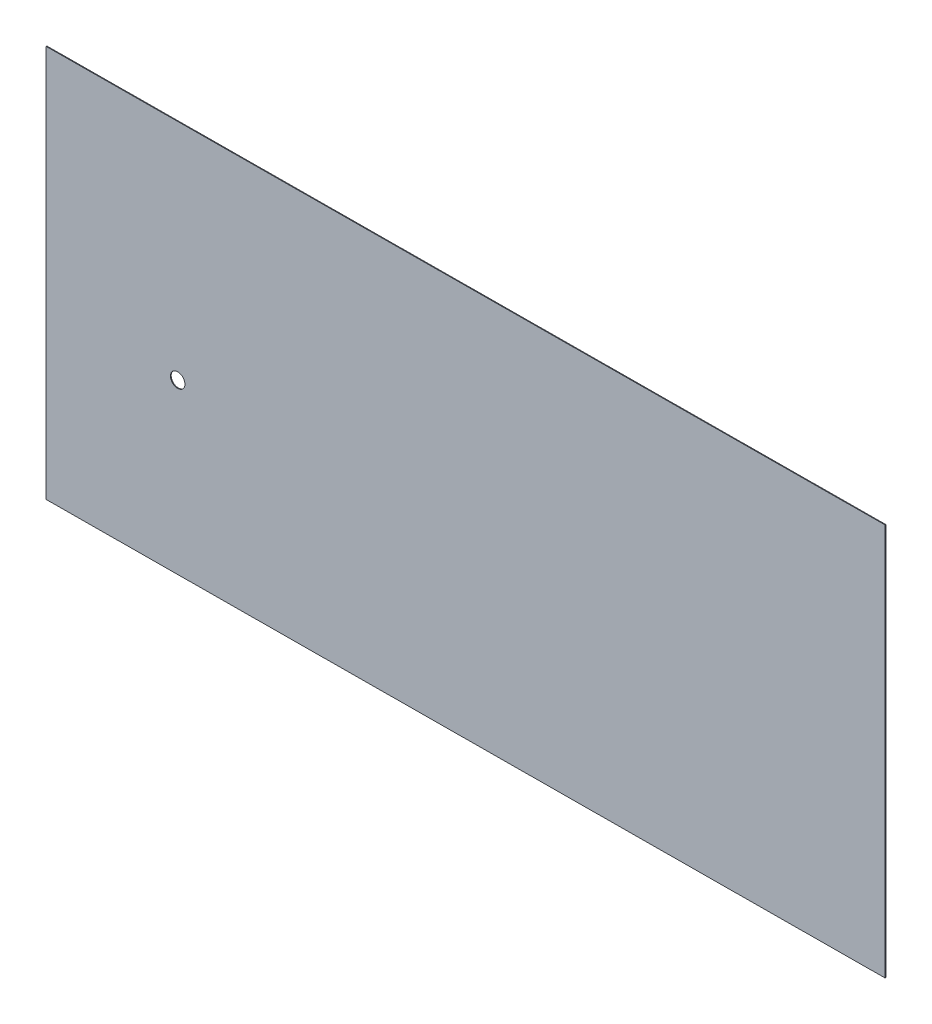
ISO-10303-21;
HEADER;
FILE_DESCRIPTION(('STEP AP214'),'2;1');
FILE_NAME('part.step','',(''),(''),'','','');
FILE_SCHEMA(('AUTOMOTIVE_DESIGN { 1 0 10303 214 1 1 1 1 }'));
ENDSEC;
DATA;
#1=APPLICATION_CONTEXT('core data for automotive mechanical design processes');
#2=APPLICATION_PROTOCOL_DEFINITION('international standard','automotive_design',2000,#1);
#3=PRODUCT_CONTEXT('',#1,'mechanical');
#4=PRODUCT('Part','Part','',(#3));
#5=PRODUCT_RELATED_PRODUCT_CATEGORY('part','',(#4));
#6=PRODUCT_DEFINITION_FORMATION('','',#4);
#7=PRODUCT_DEFINITION_CONTEXT('part definition',#1,'design');
#8=PRODUCT_DEFINITION('design','',#6,#7);
#9=PRODUCT_DEFINITION_SHAPE('','',#8);
#10=(LENGTH_UNIT() NAMED_UNIT(*) SI_UNIT(.MILLI.,.METRE.));
#11=(NAMED_UNIT(*) PLANE_ANGLE_UNIT() SI_UNIT($,.RADIAN.));
#12=(NAMED_UNIT(*) SI_UNIT($,.STERADIAN.) SOLID_ANGLE_UNIT());
#13=UNCERTAINTY_MEASURE_WITH_UNIT(LENGTH_MEASURE(1.E-05),#10,'distance_accuracy_value','');
#14=(GEOMETRIC_REPRESENTATION_CONTEXT(3) GLOBAL_UNCERTAINTY_ASSIGNED_CONTEXT((#13)) GLOBAL_UNIT_ASSIGNED_CONTEXT((#10,
#11,#12)) REPRESENTATION_CONTEXT('',''));
#15=CARTESIAN_POINT('',(0.,0.,0.));
#16=DIRECTION('',(0.,0.,1.));
#17=DIRECTION('',(1.,0.,0.));
#18=AXIS2_PLACEMENT_3D('',#15,#16,#17);
#19=CARTESIAN_POINT('',(-4.99393203883525,546.5,-822.984848367691));
#20=DIRECTION('',(0.999981589754181,0.,-0.00606796116504866));
#21=DIRECTION('',(0.,1.,0.));
#22=AXIS2_PLACEMENT_3D('',#19,#20,#21);
#23=PLANE('',#22);
#24=DIRECTION('',(0.00606796116504867,0.,0.999981589754181));
#25=VECTOR('',#24,1.);
#26=CARTESIAN_POINT('',(-4.99393203883525,1093.,-822.984848367691));
#27=LINE('',#26,#25);
#28=CARTESIAN_POINT('',(-5.000000000001,1093.,-823.984829957446));
#29=VERTEX_POINT('',#28);
#30=CARTESIAN_POINT('',(-4.9878640776706,1093.,-821.984866777937));
#31=VERTEX_POINT('',#30);
#32=EDGE_CURVE('E11',#29,#31,#27,.T.);
#33=ORIENTED_EDGE('',*,*,#32,.F.);
#34=DIRECTION('',(0.,1.,0.));
#35=VECTOR('',#34,1.);
#36=CARTESIAN_POINT('',(-5.000000000001,546.5,-823.984829957446));
#37=LINE('',#36,#35);
#38=CARTESIAN_POINT('',(-5.000000000001,0.,-823.984829957446));
#39=VERTEX_POINT('',#38);
#40=EDGE_CURVE('E79',#29,#39,#37,.F.);
#41=ORIENTED_EDGE('',*,*,#40,.T.);
#42=DIRECTION('',(0.00606796116504867,0.,0.999981589754181));
#43=VECTOR('',#42,1.);
#44=CARTESIAN_POINT('',(-4.99393203883525,0.,-822.984848367691));
#45=LINE('',#44,#43);
#46=CARTESIAN_POINT('',(-4.9878640776706,0.,-821.984866777937));
#47=VERTEX_POINT('',#46);
#48=EDGE_CURVE('E51',#39,#47,#45,.T.);
#49=ORIENTED_EDGE('',*,*,#48,.T.);
#50=DIRECTION('',(0.,1.,0.));
#51=VECTOR('',#50,1.);
#52=CARTESIAN_POINT('',(-4.9878640776706,546.5,-821.984866777937));
#53=LINE('',#52,#51);
#54=EDGE_CURVE('E81',#31,#47,#53,.F.);
#55=ORIENTED_EDGE('',*,*,#54,.F.);
#56=EDGE_LOOP('',(#33,#41,#49,#55));
#57=FACE_BOUND('',#56,.T.);
#58=ADVANCED_FACE('F41',(#57),#23,.F.);
#59=CARTESIAN_POINT('',(1156.30423815181,0.,-830.031690299543));
#60=DIRECTION('',(0.,-1.,0.));
#61=DIRECTION('',(0.999981589754181,0.,-0.00606796116504866));
#62=AXIS2_PLACEMENT_3D('',#59,#60,#61);
#63=PLANE('',#62);
#64=ORIENTED_EDGE('',*,*,#48,.F.);
#65=DIRECTION('',(0.999981589754181,0.,-0.00606796116504866));
#66=VECTOR('',#65,1.);
#67=CARTESIAN_POINT('',(1156.29817019064,0.,-831.031671889297));
#68=LINE('',#67,#66);
#69=CARTESIAN_POINT('',(2317.59634038129,0.,-838.078513821148));
#70=VERTEX_POINT('',#69);
#71=EDGE_CURVE('E93',#39,#70,#68,.T.);
#72=ORIENTED_EDGE('',*,*,#71,.T.);
#73=DIRECTION('',(0.00606796116504867,0.,0.999981589754181));
#74=VECTOR('',#73,1.);
#75=CARTESIAN_POINT('',(2317.60240834245,0.,-837.078532231394));
#76=LINE('',#75,#74);
#77=CARTESIAN_POINT('',(2317.60847630362,0.,-836.078550641639));
#78=VERTEX_POINT('',#77);
#79=EDGE_CURVE('E108',#70,#78,#76,.T.);
#80=ORIENTED_EDGE('',*,*,#79,.T.);
#81=DIRECTION('',(0.999981589754181,0.,-0.00606796116504866));
#82=VECTOR('',#81,1.);
#83=CARTESIAN_POINT('',(1156.31030611297,0.,-829.031708709788));
#84=LINE('',#83,#82);
#85=EDGE_CURVE('E102',#47,#78,#84,.T.);
#86=ORIENTED_EDGE('',*,*,#85,.F.);
#87=EDGE_LOOP('',(#64,#72,#80,#86));
#88=FACE_BOUND('',#87,.T.);
#89=ADVANCED_FACE('F116',(#88),#63,.T.);
#90=CARTESIAN_POINT('',(2317.60240834245,546.5,-837.078532231394));
#91=DIRECTION('',(0.999981589754181,0.,-0.00606796116504866));
#92=DIRECTION('',(0.,1.,0.));
#93=AXIS2_PLACEMENT_3D('',#90,#91,#92);
#94=PLANE('',#93);
#95=ORIENTED_EDGE('',*,*,#79,.F.);
#96=DIRECTION('',(0.,1.,0.));
#97=VECTOR('',#96,1.);
#98=CARTESIAN_POINT('',(2317.59634038129,546.5,-838.078513821148));
#99=LINE('',#98,#97);
#100=CARTESIAN_POINT('',(2317.59634038129,1093.,-838.078513821148));
#101=VERTEX_POINT('',#100);
#102=EDGE_CURVE('E98',#70,#101,#99,.T.);
#103=ORIENTED_EDGE('',*,*,#102,.T.);
#104=DIRECTION('',(0.00606796116504867,0.,0.999981589754181));
#105=VECTOR('',#104,1.);
#106=CARTESIAN_POINT('',(2317.60240834245,1093.,-837.078532231394));
#107=LINE('',#106,#105);
#108=CARTESIAN_POINT('',(2317.60847630362,1093.,-836.078550641639));
#109=VERTEX_POINT('',#108);
#110=EDGE_CURVE('E45',#101,#109,#107,.T.);
#111=ORIENTED_EDGE('',*,*,#110,.T.);
#112=DIRECTION('',(0.,1.,0.));
#113=VECTOR('',#112,1.);
#114=CARTESIAN_POINT('',(2317.60847630362,546.5,-836.078550641639));
#115=LINE('',#114,#113);
#116=EDGE_CURVE('E118',#78,#109,#115,.T.);
#117=ORIENTED_EDGE('',*,*,#116,.F.);
#118=EDGE_LOOP('',(#95,#103,#111,#117));
#119=FACE_BOUND('',#118,.T.);
#120=ADVANCED_FACE('F171',(#119),#94,.T.);
#121=CARTESIAN_POINT('',(1156.30423815181,1093.,-830.031690299543));
#122=DIRECTION('',(0.,-1.,0.));
#123=DIRECTION('',(0.999981589754181,0.,-0.00606796116504866));
#124=AXIS2_PLACEMENT_3D('',#121,#122,#123);
#125=PLANE('',#124);
#126=DIRECTION('',(0.999981589754181,0.,-0.00606796116504866));
#127=VECTOR('',#126,1.);
#128=CARTESIAN_POINT('',(1156.29817019064,1093.,-831.031671889297));
#129=LINE('',#128,#127);
#130=EDGE_CURVE('E91',#101,#29,#129,.F.);
#131=ORIENTED_EDGE('',*,*,#130,.T.);
#132=ORIENTED_EDGE('',*,*,#32,.T.);
#133=DIRECTION('',(0.999981589754181,0.,-0.00606796116504866));
#134=VECTOR('',#133,1.);
#135=CARTESIAN_POINT('',(1156.31030611297,1093.,-829.031708709788));
#136=LINE('',#135,#134);
#137=EDGE_CURVE('E115',#109,#31,#136,.F.);
#138=ORIENTED_EDGE('',*,*,#137,.F.);
#139=ORIENTED_EDGE('',*,*,#110,.F.);
#140=EDGE_LOOP('',(#131,#132,#138,#139));
#141=FACE_BOUND('',#140,.T.);
#142=ADVANCED_FACE('F43',(#141),#125,.F.);
#143=CARTESIAN_POINT('',(1156.31030611297,546.5,-829.031708709788));
#144=DIRECTION('',(0.00606796116504867,0.,0.999981589754181));
#145=DIRECTION('',(0.999981589754181,0.,-0.00606796116504866));
#146=AXIS2_PLACEMENT_3D('',#143,#144,#145);
#147=PLANE('',#146);
#148=CARTESIAN_POINT('',(339.074950675495,469.0000000268,-824.072665013075));
#149=CARTESIAN_POINT('',(339.074952175354,468.328584783968,-824.072665022177));
#150=CARTESIAN_POINT('',(339.109270419941,467.657108868376,-824.072873267786));
#151=CARTESIAN_POINT('',(339.245169879086,466.321042548984,-824.073697915608));
#152=CARTESIAN_POINT('',(339.346748960097,465.656451927458,-824.074314304875));
#153=CARTESIAN_POINT('',(339.593612302406,464.449151278049,-824.075812289628));
#154=CARTESIAN_POINT('',(339.728953983658,463.904381306161,-824.076633552813));
#155=CARTESIAN_POINT('',(340.044908442255,462.827879149409,-824.078550787494));
#156=CARTESIAN_POINT('',(340.225531299392,462.296149896439,-824.079646820155));
#157=CARTESIAN_POINT('',(340.529891044368,461.51132230611,-824.08149369727));
#158=CARTESIAN_POINT('',(340.637000907703,461.251665596134,-824.082143647727));
#159=CARTESIAN_POINT('',(340.86218373962,460.737150092206,-824.083510073562));
#160=CARTESIAN_POINT('',(340.980256731423,460.482291308418,-824.084226549081));
#161=CARTESIAN_POINT('',(341.350458081397,459.725569546191,-824.086472957853));
#162=CARTESIAN_POINT('',(341.618616336485,459.231438855324,-824.088100161688));
#163=CARTESIAN_POINT('',(342.195074381275,458.267799266706,-824.091598151116));
#164=CARTESIAN_POINT('',(342.503342534786,457.798271368953,-824.093468744738));
#165=CARTESIAN_POINT('',(343.158007303258,456.886586975724,-824.097441298265));
#166=CARTESIAN_POINT('',(343.504402925405,456.444429768001,-824.099543252146));
#167=CARTESIAN_POINT('',(344.23306707273,455.590874551994,-824.103964839296));
#168=CARTESIAN_POINT('',(344.615328194218,455.179470226782,-824.106284427641));
#169=CARTESIAN_POINT('',(345.413449958345,454.390659581939,-824.111127488672));
#170=CARTESIAN_POINT('',(345.829310711533,454.013253374179,-824.11365096203));
#171=CARTESIAN_POINT('',(346.692037001546,453.293955871417,-824.118886048034));
#172=CARTESIAN_POINT('',(347.138960933633,452.952134658138,-824.121598015025));
#173=CARTESIAN_POINT('',(348.059793722772,452.307013749988,-824.1271856955));
#174=CARTESIAN_POINT('',(348.533703530012,452.003715412744,-824.130061414749));
#175=CARTESIAN_POINT('',(349.505342994726,451.437768861924,-824.135957393833));
#176=CARTESIAN_POINT('',(350.003074469016,451.175123755352,-824.138977664694));
#177=CARTESIAN_POINT('',(350.764818901969,450.813411875849,-824.143599985429));
#178=CARTESIAN_POINT('',(351.021279558414,450.698209217535,-824.145156207383));
#179=CARTESIAN_POINT('',(351.538873406771,450.478828487614,-824.148297004577));
#180=CARTESIAN_POINT('',(351.800006590888,450.374650397616,-824.149881579769));
#181=CARTESIAN_POINT('',(352.590833119863,450.078427140048,-824.154680372782));
#182=CARTESIAN_POINT('',(353.126924769694,449.903181193952,-824.157933415984));
#183=CARTESIAN_POINT('',(354.21189057084,449.598290184663,-824.164517067537));
#184=CARTESIAN_POINT('',(354.760765850328,449.468649162546,-824.167847682735));
#185=CARTESIAN_POINT('',(355.867441774931,449.255716661479,-824.1745630729));
#186=CARTESIAN_POINT('',(356.425242535724,449.172425783747,-824.177947848568));
#187=CARTESIAN_POINT('',(357.54589935732,449.052978130169,-824.184748075835));
#188=CARTESIAN_POINT('',(358.108754956869,449.016817096848,-824.188163524634));
#189=CARTESIAN_POINT('',(358.954231121696,448.998541146611,-824.19329393562));
#190=CARTESIAN_POINT('',(359.236562343049,448.998462945255,-824.195007142048));
#191=CARTESIAN_POINT('',(359.800971447485,449.010350512539,-824.198432017627));
#192=CARTESIAN_POINT('',(360.083049329275,449.022316342317,-824.200143686772));
#193=CARTESIAN_POINT('',(360.928159622313,449.07611148578,-824.205271877622));
#194=CARTESIAN_POINT('',(361.490153407282,449.135836677355,-824.208682096867));
#195=CARTESIAN_POINT('',(362.60705317246,449.302214176087,-824.215459526041));
#196=CARTESIAN_POINT('',(363.161959347974,449.408865187283,-824.218826737155));
#197=CARTESIAN_POINT('',(364.260873553531,449.668306810475,-824.225495028644));
#198=CARTESIAN_POINT('',(364.804882142169,449.821095051048,-824.228796112407));
#199=CARTESIAN_POINT('',(365.877594682711,450.17193830677,-824.235305410282));
#200=CARTESIAN_POINT('',(366.406311487938,450.369953982559,-824.238513702389));
#201=CARTESIAN_POINT('',(367.444915217162,450.810400686034,-824.244816025511));
#202=CARTESIAN_POINT('',(367.954801897487,451.052832288242,-824.247910055047));
#203=CARTESIAN_POINT('',(368.952320239554,451.579740142177,-824.253963069046));
#204=CARTESIAN_POINT('',(369.439953009069,451.86421429808,-824.25692206023));
#205=CARTESIAN_POINT('',(370.389667241782,452.47301412735,-824.262684995409));
#206=CARTESIAN_POINT('',(370.851748060552,452.797340805143,-824.265488935494));
#207=CARTESIAN_POINT('',(371.746367629377,453.483156167313,-824.270917552237));
#208=CARTESIAN_POINT('',(372.178953299703,453.844583423546,-824.273542513611));
#209=CARTESIAN_POINT('',(372.803609770618,454.413112882475,-824.277332974601));
#210=CARTESIAN_POINT('',(373.007807454583,454.607037906361,-824.27857206103));
#211=CARTESIAN_POINT('',(373.407732098095,455.00343441923,-824.280998832913));
#212=CARTESIAN_POINT('',(373.603459064168,455.205905901629,-824.282186518407));
#213=CARTESIAN_POINT('',(374.177444300262,455.825479544813,-824.285669502652));
#214=CARTESIAN_POINT('',(374.542616220354,456.254840469881,-824.287885392477));
#215=CARTESIAN_POINT('',(375.235603274204,457.142682538101,-824.292090488424));
#216=CARTESIAN_POINT('',(375.563415260795,457.601166129461,-824.294079675449));
#217=CARTESIAN_POINT('',(376.178940525812,458.543145122823,-824.297814727617));
#218=CARTESIAN_POINT('',(376.466723787482,459.02659479323,-824.299561017423));
#219=CARTESIAN_POINT('',(377.000654100661,460.015999684072,-824.302800945476));
#220=CARTESIAN_POINT('',(377.246805072431,460.521952779822,-824.304294607512));
#221=CARTESIAN_POINT('',(377.583000145425,461.295099422616,-824.306334663716));
#222=CARTESIAN_POINT('',(377.689570187765,461.555214884852,-824.3069813385));
#223=CARTESIAN_POINT('',(377.891539954353,462.079747459035,-824.308206905763));
#224=CARTESIAN_POINT('',(377.98693961477,462.344164595553,-824.308785797856));
#225=CARTESIAN_POINT('',(378.25625194264,463.143126324075,-824.310420004688));
#226=CARTESIAN_POINT('',(378.413311055489,463.683457490496,-824.311373050831));
#227=CARTESIAN_POINT('',(378.681368127529,464.774449967184,-824.312999640681));
#228=CARTESIAN_POINT('',(378.792437652468,465.325093823066,-824.313673618653));
#229=CARTESIAN_POINT('',(378.968135056628,466.433734533422,-824.314739763306));
#230=CARTESIAN_POINT('',(379.032765560813,466.991730970475,-824.315131945916));
#231=CARTESIAN_POINT('',(379.114734102223,468.111222716915,-824.315629336999));
#232=CARTESIAN_POINT('',(379.132070318143,468.672718160215,-824.315734534421));
#233=CARTESIAN_POINT('',(379.118809720978,469.795148377628,-824.31565406815));
#234=CARTESIAN_POINT('',(379.088212075773,470.356083141839,-824.315468399409));
#235=CARTESIAN_POINT('',(378.980024848169,471.473159084359,-824.314811911427));
#236=CARTESIAN_POINT('',(378.902454287958,472.02930211072,-824.314341207615));
#237=CARTESIAN_POINT('',(378.70111444451,473.133154837478,-824.313119462771));
#238=CARTESIAN_POINT('',(378.577344069219,473.680864338209,-824.312368415114));
#239=CARTESIAN_POINT('',(378.284339120088,474.764093713258,-824.310590439728));
#240=CARTESIAN_POINT('',(378.115102697336,475.299613090895,-824.309563500781));
#241=CARTESIAN_POINT('',(377.82781033987,476.090586390828,-824.307820189818));
#242=CARTESIAN_POINT('',(377.726463403566,476.352214537696,-824.307205209223));
#243=CARTESIAN_POINT('',(377.512706199904,476.870911505566,-824.305908114932));
#244=CARTESIAN_POINT('',(377.400295936653,477.12798032826,-824.305226001262));
#245=CARTESIAN_POINT('',(377.046565834361,477.89237554854,-824.303079541222));
#246=CARTESIAN_POINT('',(376.788969423898,478.392278150117,-824.30151642743));
#247=CARTESIAN_POINT('',(376.232794867,479.368703422376,-824.298141519685));
#248=CARTESIAN_POINT('',(375.934213216145,479.845224089063,-824.296329704467));
#249=CARTESIAN_POINT('',(375.298271341336,480.771656922457,-824.292470762823));
#250=CARTESIAN_POINT('',(374.960910467409,481.221568642984,-824.290423632453));
#251=CARTESIAN_POINT('',(374.249596612627,482.091512049361,-824.286107328142));
#252=CARTESIAN_POINT('',(373.875646950778,482.511546439456,-824.283838174341));
#253=CARTESIAN_POINT('',(373.288560056597,483.11705250429,-824.28027568828));
#254=CARTESIAN_POINT('',(373.088205942675,483.315056143921,-824.279059924915));
#255=CARTESIAN_POINT('',(372.679248696577,483.702352719295,-824.276578342541));
#256=CARTESIAN_POINT('',(372.470645513868,483.891645601659,-824.275312523225));
#257=CARTESIAN_POINT('',(371.833097763102,484.446056389193,-824.271443837009));
#258=CARTESIAN_POINT('',(371.392357640631,484.797765506333,-824.268769393825));
#259=CARTESIAN_POINT('',(370.483057289835,485.462965174763,-824.263251693027));
#260=CARTESIAN_POINT('',(370.014497566065,485.776456418881,-824.260408438474));
#261=CARTESIAN_POINT('',(369.052715495149,486.363137401864,-824.254572274774));
#262=CARTESIAN_POINT('',(368.559494522956,486.636329384209,-824.251579373969));
#263=CARTESIAN_POINT('',(367.803712365125,487.014210949669,-824.246993232754));
#264=CARTESIAN_POINT('',(367.549031736174,487.134891523151,-824.245447812136));
#265=CARTESIAN_POINT('',(367.034769095232,487.365313273446,-824.242327228951));
#266=CARTESIAN_POINT('',(366.77518711266,487.47505451589,-824.240752066563));
#267=CARTESIAN_POINT('',(365.989786958281,487.787511641157,-824.235986201186));
#268=CARTESIAN_POINT('',(365.457211859471,487.973512303251,-824.232754496673));
#269=CARTESIAN_POINT('',(364.37841883179,488.300056202502,-824.226208301959));
#270=CARTESIAN_POINT('',(363.83220155359,488.440601603224,-824.222893815706));
#271=CARTESIAN_POINT('',(362.729916581183,488.675521207358,-824.21620507016));
#272=CARTESIAN_POINT('',(362.173848689398,488.769894483583,-824.212830809666));
#273=CARTESIAN_POINT('',(361.055857900588,488.911663771668,-824.206046760081));
#274=CARTESIAN_POINT('',(360.493936918798,488.959074690932,-824.202636982611));
#275=CARTESIAN_POINT('',(359.649707434912,488.99439437731,-824.197514136575));
#276=CARTESIAN_POINT('',(359.368048937001,489.000200462188,-824.195805012283));
#277=CARTESIAN_POINT('',(358.804740816556,488.999788934876,-824.192386817554));
#278=CARTESIAN_POINT('',(358.523091194024,488.993571320737,-824.190677747118));
#279=CARTESIAN_POINT('',(357.678961839336,488.95702484658,-824.185555508674));
#280=CARTESIAN_POINT('',(357.117157180109,488.908808330006,-824.182146437057));
#281=CARTESIAN_POINT('',(355.999601031846,488.765468324197,-824.175365024902));
#282=CARTESIAN_POINT('',(355.443850039914,488.670341012053,-824.17199268738));
#283=CARTESIAN_POINT('',(354.342483501728,488.433997701838,-824.165309514959));
#284=CARTESIAN_POINT('',(353.796863404374,488.292802955359,-824.161998652444));
#285=CARTESIAN_POINT('',(352.719444192978,487.965103035531,-824.155460794147));
#286=CARTESIAN_POINT('',(352.187643810326,487.77860203755,-824.152233790668));
#287=CARTESIAN_POINT('',(351.141853696899,487.360966134576,-824.145887860042));
#288=CARTESIAN_POINT('',(350.627864217071,487.129830601006,-824.142768934419));
#289=CARTESIAN_POINT('',(349.621177617009,486.625021319542,-824.136660286763));
#290=CARTESIAN_POINT('',(349.128482290741,486.351343996527,-824.133670575616));
#291=CARTESIAN_POINT('',(348.167979228309,485.76388990398,-824.127842173032));
#292=CARTESIAN_POINT('',(347.700158982433,485.4501335656,-824.125003405685));
#293=CARTESIAN_POINT('',(346.792389726971,484.784529605132,-824.119494995685));
#294=CARTESIAN_POINT('',(346.352439020317,484.432684305949,-824.116825342733));
#295=CARTESIAN_POINT('',(345.716045241389,483.878128476373,-824.112963658903));
#296=CARTESIAN_POINT('',(345.507816558485,483.688791794085,-824.111700112079));
#297=CARTESIAN_POINT('',(345.099604715721,483.301429321405,-824.109223052867));
#298=CARTESIAN_POINT('',(344.899621511144,483.103403578148,-824.108009540207));
#299=CARTESIAN_POINT('',(344.312615221318,482.496816821291,-824.104447543259));
#300=CARTESIAN_POINT('',(343.938451109496,482.075672792408,-824.10217708816));
#301=CARTESIAN_POINT('',(343.227176974005,481.203834421196,-824.097861024868));
#302=CARTESIAN_POINT('',(342.890037958911,480.753163646851,-824.095815240754));
#303=CARTESIAN_POINT('',(342.254626174613,479.825198867051,-824.091959515738));
#304=CARTESIAN_POINT('',(341.956353917889,479.347904510669,-824.090149577946));
#305=CARTESIAN_POINT('',(341.400761819851,478.369692677941,-824.086778204604));
#306=CARTESIAN_POINT('',(341.143459195437,477.868765384219,-824.085216873527));
#307=CARTESIAN_POINT('',(340.790131946014,477.102492350908,-824.083072858027));
#308=CARTESIAN_POINT('',(340.677785559052,476.844564393553,-824.082391131963));
#309=CARTESIAN_POINT('',(340.464222065708,476.324140835307,-824.081095213121));
#310=CARTESIAN_POINT('',(340.363005029024,476.061645205822,-824.080481020765));
#311=CARTESIAN_POINT('',(340.070864330367,475.253304268342,-824.078708289715));
#312=CARTESIAN_POINT('',(339.898011162659,474.700806956101,-824.077659404096));
#313=CARTESIAN_POINT('',(339.600619008273,473.582950371683,-824.07585480683));
#314=CARTESIAN_POINT('',(339.476088501504,473.017588860443,-824.075099146639));
#315=CARTESIAN_POINT('',(339.276312491995,471.878922220276,-824.073886891253));
#316=CARTESIAN_POINT('',(339.201005616047,471.305627896899,-824.073429923642));
#317=CARTESIAN_POINT('',(339.100333750341,470.154902890722,-824.072819039424));
#318=CARTESIAN_POINT('',(339.07494938549,469.577473899959,-824.072665005248));
#319=CARTESIAN_POINT('',(339.074950675495,469.0000000268,-824.072665013075));
#320=B_SPLINE_CURVE_WITH_KNOTS('',3,(#148,#149,#150,#151,#152,#153,#154,#155,#156,#157,#158,
#159,#160,#161,#162,#163,#164,#165,#166,#167,#168,#169,#170,#171,#172,#173,#174,#175,#176,#177,
#178,#179,#180,#181,#182,#183,#184,#185,#186,#187,#188,#189,#190,#191,#192,#193,#194,#195,#196,
#197,#198,#199,#200,#201,#202,#203,#204,#205,#206,#207,#208,#209,#210,#211,#212,#213,#214,#215,
#216,#217,#218,#219,#220,#221,#222,#223,#224,#225,#226,#227,#228,#229,#230,#231,#232,#233,#234,
#235,#236,#237,#238,#239,#240,#241,#242,#243,#244,#245,#246,#247,#248,#249,#250,#251,#252,#253,
#254,#255,#256,#257,#258,#259,#260,#261,#262,#263,#264,#265,#266,#267,#268,#269,#270,#271,#272,
#273,#274,#275,#276,#277,#278,#279,#280,#281,#282,#283,#284,#285,#286,#287,#288,#289,#290,#291,
#292,#293,#294,#295,#296,#297,#298,#299,#300,#301,#302,#303,#304,#305,#306,#307,#308,#309,#310,
#311,#312,#313,#314,#315,#316,#317,#318,#319),.UNSPECIFIED.,.T.,.F.,(4,2,2,2,2,2,2,2,2,2,2,2,2,
2,2,2,2,2,2,2,2,2,2,2,2,2,2,2,2,2,2,2,2,2,2,2,2,2,2,2,2,2,2,2,2,2,2,2,2,2,2,2,2,2,2,2,2,2,2,2,2,
2,2,2,2,2,2,2,2,2,2,2,2,2,2,2,2,2,2,2,2,2,2,2,2,4),(0.,2.01353392695023,4.02700398669606,
5.70914538217014,7.39166156289532,8.23408621213205,9.07651264581496,10.760973159179,
12.4441130387638,14.12720910087,15.8099584838925,17.4927134037393,19.1787220547761,
20.8647901078503,22.5509869584557,23.3942214977713,24.2374546303952,25.9273256999312,
27.6173464720607,29.3073891653202,30.9972791779925,31.8440640693849,32.6908532593373,
34.3841782275761,36.0774564338275,37.7706476215787,39.4623716226229,41.1541175077314,
42.8457790876292,44.5374833122072,46.2264303966459,47.0710434810042,47.9156559147642,
49.6044386485476,51.2933635388285,52.9792974908214,54.665072600086,55.5081520887305,
56.3512363947963,58.0371564276551,59.7204430006888,61.4036344185279,63.0868906552236,
64.7701761131278,66.4527803618988,68.1354243859701,69.8181368464537,70.659633679672,
71.5011302004871,73.1860722213508,74.8711584020827,76.5562728303415,78.2412345416283,
79.0860777051074,79.9309260448619,81.6203765225386,83.3097963686769,84.9991221284454,
85.844395323791,86.6896634474991,88.3798562670362,90.0699686254502,91.7601149217992,
93.4497245378081,94.294673018027,95.1396216351712,96.8290865863068,98.5186892400169,
100.207513554385,101.896182287845,103.584874804141,105.273709311314,106.961686308532,
108.649560420214,109.493664803831,110.33776460901,112.025629706165,113.712163602028,
115.398719733541,117.085982756098,117.929762222285,118.773546972376,120.507891631564,
122.242540504946,123.975022429757,125.706831839724),.UNSPECIFIED.);
#321=CARTESIAN_POINT('',(379.126827566034,469.,-824.315702721019));
#322=VERTEX_POINT('',#321);
#323=EDGE_CURVE('E95',#322,#322,#320,.F.);
#324=ORIENTED_EDGE('',*,*,#323,.T.);
#325=EDGE_LOOP('',(#324));
#326=FACE_BOUND('',#325,.T.);
#327=ORIENTED_EDGE('',*,*,#116,.T.);
#328=ORIENTED_EDGE('',*,*,#137,.T.);
#329=ORIENTED_EDGE('',*,*,#54,.T.);
#330=ORIENTED_EDGE('',*,*,#85,.T.);
#331=EDGE_LOOP('',(#327,#328,#329,#330));
#332=FACE_BOUND('',#331,.T.);
#333=ADVANCED_FACE('F114',(#326,#332),#147,.T.);
#334=CARTESIAN_POINT('',(1156.29817019064,546.5,-831.031671889297));
#335=DIRECTION('',(0.00606796116504867,0.,0.999981589754181));
#336=DIRECTION('',(0.999981589754181,0.,-0.00606796116504866));
#337=AXIS2_PLACEMENT_3D('',#334,#335,#336);
#338=PLANE('',#337);
#339=CARTESIAN_POINT('',(339.111430960637,469.000000024332,-826.072923199274));
#340=CARTESIAN_POINT('',(339.111432415972,469.671394371171,-826.072923208105));
#341=CARTESIAN_POINT('',(339.145653939678,470.342848187122,-826.073130866805));
#342=CARTESIAN_POINT('',(339.281199721399,471.678903886554,-826.073953368487));
#343=CARTESIAN_POINT('',(339.382521656179,472.343506006455,-826.074568197371));
#344=CARTESIAN_POINT('',(339.62899092243,473.551834998791,-826.076063790842));
#345=CARTESIAN_POINT('',(339.764294214453,474.097596151142,-826.076884821079));
#346=CARTESIAN_POINT('',(340.080255350267,475.176081349034,-826.078802096278));
#347=CARTESIAN_POINT('',(340.260923331118,475.708802451444,-826.079898402753));
#348=CARTESIAN_POINT('',(340.565421845941,476.495110421861,-826.081746121932));
#349=CARTESIAN_POINT('',(340.672590127967,476.755260208834,-826.082396426878));
#350=CARTESIAN_POINT('',(340.89791136495,477.270758639712,-826.083763692566));
#351=CARTESIAN_POINT('',(341.016064345023,477.526107272637,-826.08448065346));
#352=CARTESIAN_POINT('',(341.386543350173,478.284289838733,-826.086728747063));
#353=CARTESIAN_POINT('',(341.654936957909,478.779382910244,-826.088357379036));
#354=CARTESIAN_POINT('',(342.231946568775,479.744821204885,-826.091858715407));
#355=CARTESIAN_POINT('',(342.540524694286,480.215189154929,-826.093731189961));
#356=CARTESIAN_POINT('',(343.195942239001,481.128475078535,-826.097708311389));
#357=CARTESIAN_POINT('',(343.542780583001,481.571393822942,-826.099812951738));
#358=CARTESIAN_POINT('',(344.2724816247,482.426344493428,-826.10424083084));
#359=CARTESIAN_POINT('',(344.655336615651,482.838382993432,-826.106564022827));
#360=CARTESIAN_POINT('',(345.454786098481,483.62831366243,-826.111415140553));
#361=CARTESIAN_POINT('',(345.87138075344,484.006205666357,-826.11394306728));
#362=CARTESIAN_POINT('',(346.734767341825,484.725523599301,-826.119182160022));
#363=CARTESIAN_POINT('',(347.181552439548,485.066957738212,-826.121893284557));
#364=CARTESIAN_POINT('',(348.102118669631,485.711248501386,-826.127479347531));
#365=CARTESIAN_POINT('',(348.575900640201,486.014103926895,-826.130354291058));
#366=CARTESIAN_POINT('',(349.54730104495,486.57906909734,-826.136248819509));
#367=CARTESIAN_POINT('',(350.044921097085,486.841176071425,-826.139268414252));
#368=CARTESIAN_POINT('',(350.806512053352,487.201976669059,-826.143889803679));
#369=CARTESIAN_POINT('',(351.062924008856,487.316858258698,-826.145445730113));
#370=CARTESIAN_POINT('',(351.580422693765,487.535559309964,-826.148585949848));
#371=CARTESIAN_POINT('',(351.84150941579,487.639378789049,-826.150170243105));
#372=CARTESIAN_POINT('',(352.63094037469,487.934011773649,-826.154960567697));
#373=CARTESIAN_POINT('',(353.165637259132,488.108085903585,-826.15820514736));
#374=CARTESIAN_POINT('',(354.247731722868,488.410706683448,-826.164771375429));
#375=CARTESIAN_POINT('',(354.795130410664,488.539249343751,-826.168093030561));
#376=CARTESIAN_POINT('',(355.898772743475,488.750044542416,-826.17479001267));
#377=CARTESIAN_POINT('',(356.455016439535,488.832296813538,-826.178165339956));
#378=CARTESIAN_POINT('',(357.572482726411,488.949711572872,-826.184946206826));
#379=CARTESIAN_POINT('',(358.133704848277,488.984878449933,-826.188351743563));
#380=CARTESIAN_POINT('',(358.976259789769,489.001673401992,-826.193464428353));
#381=CARTESIAN_POINT('',(359.25733369047,489.001272490971,-826.195170005267));
#382=CARTESIAN_POINT('',(359.819208711556,488.988477038839,-826.198579503844));
#383=CARTESIAN_POINT('',(360.100009830508,488.976082435056,-826.200283425499));
#384=CARTESIAN_POINT('',(360.941264485712,488.921078092149,-826.205388220057));
#385=CARTESIAN_POINT('',(361.500653035838,488.860649434086,-826.208782630547));
#386=CARTESIAN_POINT('',(362.612290484417,488.693084024223,-826.215528127601));
#387=CARTESIAN_POINT('',(363.164539600696,488.585948700935,-826.218879215487));
#388=CARTESIAN_POINT('',(364.258109342589,488.325769347073,-826.22551507638));
#389=CARTESIAN_POINT('',(364.799430543237,488.172727738874,-826.228799852876));
#390=CARTESIAN_POINT('',(365.866687485933,487.821641592119,-826.235276045786));
#391=CARTESIAN_POINT('',(366.392638176783,487.623642541194,-826.238467552909));
#392=CARTESIAN_POINT('',(367.425733904799,487.183493424591,-826.244736453079));
#393=CARTESIAN_POINT('',(367.93287870077,486.941342792882,-826.247813844661));
#394=CARTESIAN_POINT('',(368.924977880129,486.415279117986,-826.253833974786));
#395=CARTESIAN_POINT('',(369.409933324179,486.131368073704,-826.256776719763));
#396=CARTESIAN_POINT('',(370.354401515032,485.523990406719,-826.262507821578));
#397=CARTESIAN_POINT('',(370.813913571943,485.200522712205,-826.265296174229));
#398=CARTESIAN_POINT('',(371.704104449138,484.516311246293,-826.270697917348));
#399=CARTESIAN_POINT('',(372.134794836822,484.15558257901,-826.273311378009));
#400=CARTESIAN_POINT('',(372.756709086645,483.588270606827,-826.277085199002));
#401=CARTESIAN_POINT('',(372.960009306917,483.394779834138,-826.278318839556));
#402=CARTESIAN_POINT('',(373.358177177566,482.99930788291,-826.280734951213));
#403=CARTESIAN_POINT('',(373.553044836378,482.797326712863,-826.281917422369));
#404=CARTESIAN_POINT('',(374.124517572585,482.179300261355,-826.285385160581));
#405=CARTESIAN_POINT('',(374.488096978539,481.751076575251,-826.287591386914));
#406=CARTESIAN_POINT('',(375.178109278699,480.865716795864,-826.291778431839));
#407=CARTESIAN_POINT('',(375.504538993839,480.408578233404,-826.29375923114));
#408=CARTESIAN_POINT('',(376.118263172534,479.468411715941,-826.297483354185));
#409=CARTESIAN_POINT('',(376.405537635026,478.985370703832,-826.29922655656));
#410=CARTESIAN_POINT('',(376.938573660597,477.996867116287,-826.302461058011));
#411=CARTESIAN_POINT('',(377.184339006665,477.49140658939,-826.303952380042));
#412=CARTESIAN_POINT('',(377.520083257095,476.719054634525,-826.305989700622));
#413=CARTESIAN_POINT('',(377.626524747418,476.459212042967,-826.306635595343));
#414=CARTESIAN_POINT('',(377.828276416188,475.935240290612,-826.307859839173));
#415=CARTESIAN_POINT('',(377.9235865357,475.671111107128,-826.308438187924));
#416=CARTESIAN_POINT('',(378.192692248545,474.873033026936,-826.310071141002));
#417=CARTESIAN_POINT('',(378.349696221571,474.33331749026,-826.311023852553));
#418=CARTESIAN_POINT('',(378.618133595866,473.242337197237,-826.312652750103));
#419=CARTESIAN_POINT('',(378.729533991634,472.691064378593,-826.313328735824));
#420=CARTESIAN_POINT('',(378.905882863996,471.581144202891,-826.314398833634));
#421=CARTESIAN_POINT('',(378.970833787616,471.022497235894,-826.314792960572));
#422=CARTESIAN_POINT('',(379.053452965461,469.901678619033,-826.315294299764));
#423=CARTESIAN_POINT('',(379.071119103923,469.339506812577,-826.31540149918));
#424=CARTESIAN_POINT('',(379.058530356608,468.215694606802,-826.315325109744));
#425=CARTESIAN_POINT('',(379.028274668097,467.654054216542,-826.315141516021));
#426=CARTESIAN_POINT('',(378.920697840084,466.534883909642,-826.314488731988));
#427=CARTESIAN_POINT('',(378.843341152643,465.977357419805,-826.314019325971));
#428=CARTESIAN_POINT('',(378.642296808713,464.870728015562,-826.31279937424));
#429=CARTESIAN_POINT('',(378.518608036505,464.32162530434,-826.312048821756));
#430=CARTESIAN_POINT('',(378.22562153977,463.235615114568,-826.310270958341));
#431=CARTESIAN_POINT('',(378.056321933616,462.698708140132,-826.309243635992));
#432=CARTESIAN_POINT('',(377.768818522318,461.905673151599,-826.307499044339));
#433=CARTESIAN_POINT('',(377.667381776364,461.643360859823,-826.306883518772));
#434=CARTESIAN_POINT('',(377.453406967899,461.123303943299,-826.30558510404));
#435=CARTESIAN_POINT('',(377.340868908462,460.865559317287,-826.304902214894));
#436=CARTESIAN_POINT('',(376.986816859009,460.099408855869,-826.302753801254));
#437=CARTESIAN_POINT('',(376.728990593945,459.598432459249,-826.301189292688));
#438=CARTESIAN_POINT('',(376.172221625662,458.619910742526,-826.297810778011));
#439=CARTESIAN_POINT('',(375.873275456785,458.142367402009,-826.295996750871));
#440=CARTESIAN_POINT('',(375.236450334869,457.21397789726,-826.29213244962));
#441=CARTESIAN_POINT('',(374.898570905634,456.76313205967,-826.290082172618));
#442=CARTESIAN_POINT('',(374.186048697633,455.891450320346,-826.285758535932));
#443=CARTESIAN_POINT('',(373.811409320333,455.470611648205,-826.283485196887));
#444=CARTESIAN_POINT('',(373.223507499311,454.864395642257,-826.279917765791));
#445=CARTESIAN_POINT('',(373.023108946966,454.666403899723,-826.27870173277));
#446=CARTESIAN_POINT('',(372.614055348619,454.279141862159,-826.276219565724));
#447=CARTESIAN_POINT('',(372.405400251611,454.089871621023,-826.274953431388));
#448=CARTESIAN_POINT('',(371.76768075787,453.535551425129,-826.271083703023));
#449=CARTESIAN_POINT('',(371.326805091766,453.183933230752,-826.26840843735));
#450=CARTESIAN_POINT('',(370.417187165994,452.519014799735,-826.262888809484));
#451=CARTESIAN_POINT('',(369.948445628532,452.205713570669,-826.260044451673));
#452=CARTESIAN_POINT('',(368.986247247567,451.619554196641,-826.254205761773));
#453=CARTESIAN_POINT('',(368.492791910456,451.346693590687,-826.251211438824));
#454=CARTESIAN_POINT('',(367.737175199457,450.969724482868,-826.246626301553));
#455=CARTESIAN_POINT('',(367.482922645978,450.849531355049,-826.245083478528));
#456=CARTESIAN_POINT('',(366.969525978779,450.620090849681,-826.241968150135));
#457=CARTESIAN_POINT('',(366.710381895029,450.510843405094,-826.240395644949));
#458=CARTESIAN_POINT('',(365.926315647088,450.199864509217,-826.235637873814));
#459=CARTESIAN_POINT('',(365.39465773979,450.014845717725,-826.232411734885));
#460=CARTESIAN_POINT('',(364.317762161853,449.690269036558,-826.225877054035));
#461=CARTESIAN_POINT('',(363.7725252746,449.550708530856,-826.222568516866));
#462=CARTESIAN_POINT('',(362.67226386694,449.317776978639,-826.215892050457));
#463=CARTESIAN_POINT('',(362.117239186889,449.224406686231,-826.212524120249));
#464=CARTESIAN_POINT('',(361.002499051709,449.084815118321,-826.205759795866));
#465=CARTESIAN_POINT('',(360.442797166736,449.038486893467,-826.202363484037));
#466=CARTESIAN_POINT('',(359.601958494666,449.004692556594,-826.197261213695));
#467=CARTESIAN_POINT('',(359.321440775906,448.999378508364,-826.195559011734));
#468=CARTESIAN_POINT('',(358.76043443477,449.000737607027,-826.19215478437));
#469=CARTESIAN_POINT('',(358.479945812414,449.007410761771,-826.190452758967));
#470=CARTESIAN_POINT('',(357.63933188424,449.045260002443,-826.185351852387));
#471=CARTESIAN_POINT('',(357.079910103521,449.094259974469,-826.181957240252));
#472=CARTESIAN_POINT('',(355.967180505927,449.238986315587,-826.175205115958));
#473=CARTESIAN_POINT('',(355.413873194502,449.334716518488,-826.171847606867));
#474=CARTESIAN_POINT('',(354.317851842176,449.571981722316,-826.165196869423));
#475=CARTESIAN_POINT('',(353.775125755286,449.713460969046,-826.161903567974));
#476=CARTESIAN_POINT('',(352.703499288073,450.04145781636,-826.155400860472));
#477=CARTESIAN_POINT('',(352.174597612721,450.227971181403,-826.152191446559));
#478=CARTESIAN_POINT('',(351.134580198688,450.64535160626,-826.145880545095));
#479=CARTESIAN_POINT('',(350.623464735334,450.876219352311,-826.142779059213));
#480=CARTESIAN_POINT('',(349.622461809771,451.380194337728,-826.136704900508));
#481=CARTESIAN_POINT('',(349.13257616673,451.653305187749,-826.133732238723));
#482=CARTESIAN_POINT('',(348.177147043104,452.239582892964,-826.12793462517));
#483=CARTESIAN_POINT('',(347.711613438613,452.552765824857,-826.12510973333));
#484=CARTESIAN_POINT('',(346.808310351947,453.216968234199,-826.119628424367));
#485=CARTESIAN_POINT('',(346.370539209277,453.567985445353,-826.116971997169));
#486=CARTESIAN_POINT('',(345.737295754028,454.121103229903,-826.113129429732));
#487=CARTESIAN_POINT('',(345.530096903904,454.309928403675,-826.111872132009));
#488=CARTESIAN_POINT('',(345.123898902441,454.696201212082,-826.109407292932));
#489=CARTESIAN_POINT('',(344.92489970497,454.893648798193,-826.108199751299));
#490=CARTESIAN_POINT('',(344.340772337244,455.498406579968,-826.104655223861));
#491=CARTESIAN_POINT('',(343.968430981524,455.918204640246,-826.102395829378));
#492=CARTESIAN_POINT('',(343.259790689568,456.788056919038,-826.098095748441));
#493=CARTESIAN_POINT('',(342.923542248297,457.238152128745,-826.096055368393));
#494=CARTESIAN_POINT('',(342.289789358294,458.164849337235,-826.092209709669));
#495=CARTESIAN_POINT('',(341.992285525243,458.641451757065,-826.090404434728));
#496=CARTESIAN_POINT('',(341.438060653524,459.618168800965,-826.087041357815));
#497=CARTESIAN_POINT('',(341.181357371198,460.118293539883,-826.085483663589));
#498=CARTESIAN_POINT('',(340.828766139574,460.883282717038,-826.083344114299));
#499=CARTESIAN_POINT('',(340.716637927782,461.140769370967,-826.082663712138));
#500=CARTESIAN_POINT('',(340.503454867292,461.660287238315,-826.08137010179));
#501=CARTESIAN_POINT('',(340.402400092494,461.922318482049,-826.080756894052));
#502=CARTESIAN_POINT('',(340.109849323378,462.731483954317,-826.078981674664));
#503=CARTESIAN_POINT('',(339.936532184714,463.285313160739,-826.077929973635));
#504=CARTESIAN_POINT('',(339.63836222858,464.405876766177,-826.07612065661));
#505=CARTESIAN_POINT('',(339.513518068772,464.972613451455,-826.07536309315));
#506=CARTESIAN_POINT('',(339.313252281078,466.114054739298,-826.074147865755));
#507=CARTESIAN_POINT('',(339.237769289716,466.688748538398,-826.073689829462));
#508=CARTESIAN_POINT('',(339.136867730545,467.842281295824,-826.073077551448));
#509=CARTESIAN_POINT('',(339.111429705835,468.421118555339,-826.07292319166));
#510=CARTESIAN_POINT('',(339.111430960637,469.000000024332,-826.072923199274));
#511=B_SPLINE_CURVE_WITH_KNOTS('',3,(#339,#340,#341,#342,#343,#344,#345,#346,#347,#348,#349,
#350,#351,#352,#353,#354,#355,#356,#357,#358,#359,#360,#361,#362,#363,#364,#365,#366,#367,#368,
#369,#370,#371,#372,#373,#374,#375,#376,#377,#378,#379,#380,#381,#382,#383,#384,#385,#386,#387,
#388,#389,#390,#391,#392,#393,#394,#395,#396,#397,#398,#399,#400,#401,#402,#403,#404,#405,#406,
#407,#408,#409,#410,#411,#412,#413,#414,#415,#416,#417,#418,#419,#420,#421,#422,#423,#424,#425,
#426,#427,#428,#429,#430,#431,#432,#433,#434,#435,#436,#437,#438,#439,#440,#441,#442,#443,#444,
#445,#446,#447,#448,#449,#450,#451,#452,#453,#454,#455,#456,#457,#458,#459,#460,#461,#462,#463,
#464,#465,#466,#467,#468,#469,#470,#471,#472,#473,#474,#475,#476,#477,#478,#479,#480,#481,#482,
#483,#484,#485,#486,#487,#488,#489,#490,#491,#492,#493,#494,#495,#496,#497,#498,#499,#500,#501,
#502,#503,#504,#505,#506,#507,#508,#509,#510),.UNSPECIFIED.,.T.,.F.,(4,2,2,2,2,2,2,2,2,2,2,2,2,
2,2,2,2,2,2,2,2,2,2,2,2,2,2,2,2,2,2,2,2,2,2,2,2,2,2,2,2,2,2,2,2,2,2,2,2,2,2,2,2,2,2,2,2,2,2,2,2,
2,2,2,2,2,2,2,2,2,2,2,2,2,2,2,2,2,2,2,2,2,2,2,2,4),(0.,2.0134727776223,4.02687584587381,
5.71187216667984,7.39724534744651,8.2411038841716,9.08496435036046,10.7722924618915,
12.4580414697102,14.1437431159618,15.8290848770422,17.5144347846965,19.1994043668502,
20.8844262931833,22.5695627491063,23.4122681885006,24.2549722978663,25.9397788991308,
27.6247330924397,29.3096970131175,30.994503866712,31.8375183419962,32.6805372224579,
34.3663246031991,36.0520604281771,37.7377073162157,39.4216562188609,41.1056267115204,
42.7895166253827,44.4734521753553,46.156707783933,46.9984737456864,47.8402388654453,
49.5233457167732,51.2065964910146,52.8907038969595,54.5746577365868,55.4168350022612,
56.2590167266572,57.9431320781016,59.6284641590062,61.3137074476787,62.9990261415099,
64.6843730661987,66.3709935306681,68.0576546130649,69.7443852875511,70.5878925088195,
71.4313994965039,73.1195141932903,74.8077712546452,76.4960489674176,78.1841706078297,
79.0290830109438,79.874000634431,81.5635909285517,83.2531374522381,84.9425811172525,
85.7860675545241,86.6295488254283,88.3161713542247,90.0026968043395,91.6892497879865,
93.3719597782207,94.2134575724871,95.0549559179091,96.7375084647782,98.4201990736707,
100.10084667371,101.781336267248,103.461851862821,105.14251117694,106.823846889017,
108.505081944013,109.345870738453,110.186654801842,111.867891800721,113.551451053623,
115.235037056222,116.919353758543,117.761659985322,118.603971832915,120.34253462776,
122.081407801114,123.818115159059,125.554147171806),.UNSPECIFIED.);
#512=CARTESIAN_POINT('',(379.066075436148,469.,-826.315370893836));
#513=VERTEX_POINT('',#512);
#514=EDGE_CURVE('E130',#513,#513,#511,.F.);
#515=ORIENTED_EDGE('',*,*,#514,.T.);
#516=EDGE_LOOP('',(#515));
#517=FACE_BOUND('',#516,.T.);
#518=ORIENTED_EDGE('',*,*,#102,.F.);
#519=ORIENTED_EDGE('',*,*,#71,.F.);
#520=ORIENTED_EDGE('',*,*,#40,.F.);
#521=ORIENTED_EDGE('',*,*,#130,.F.);
#522=EDGE_LOOP('',(#518,#519,#520,#521));
#523=FACE_BOUND('',#522,.T.);
#524=ADVANCED_FACE('F90',(#517,#523),#338,.F.);
#525=CARTESIAN_POINT('',(379.126827566034,469.,-824.315702721019));
#526=CARTESIAN_POINT('',(379.066075436148,469.,-826.315370893836));
#527=CARTESIAN_POINT('',(379.126827561751,466.380683791318,-824.315702720993));
#528=CARTESIAN_POINT('',(379.066075431709,466.38395845195,-826.31537089381));
#529=CARTESIAN_POINT('',(378.604560030491,463.761255761234,-824.31253356355));
#530=CARTESIAN_POINT('',(378.546546216478,463.767805222484,-826.312218352668));
#531=CARTESIAN_POINT('',(376.596249951002,458.922869367262,-824.300346991623));
#532=CARTESIAN_POINT('',(376.547000493875,458.932817860963,-826.300084963497));
#533=CARTESIAN_POINT('',(375.110104783636,456.703670663266,-824.291328954437));
#534=CARTESIAN_POINT('',(375.066878641603,456.713744829074,-826.291103476226));
#535=CARTESIAN_POINT('',(371.402279931425,453.00312326002,-824.268829603009));
#536=CARTESIAN_POINT('',(371.370346134478,453.010902172476,-826.268672647571));
#537=CARTESIAN_POINT('',(369.180339348681,451.521512830474,-824.255346705618));
#538=CARTESIAN_POINT('',(369.15367195453,451.526874081576,-826.255221707096));
#539=CARTESIAN_POINT('',(364.339350920336,449.520002818975,-824.225971235025));
#540=CARTESIAN_POINT('',(364.321038901374,449.521473126377,-826.225896937529));
#541=CARTESIAN_POINT('',(359.100887088129,448.480018839052,-824.194183854713));
#542=CARTESIAN_POINT('',(359.08875116962,448.478548593618,-826.194147034244));
#543=CARTESIAN_POINT('',(353.862423458684,449.520003863037,-824.162396475631));
#544=CARTESIAN_POINT('',(353.856463641165,449.521474171934,-826.162397132194));
#545=CARTESIAN_POINT('',(349.021435909412,451.52151461899,-824.133021010372));
#546=CARTESIAN_POINT('',(349.023831466695,451.526875872154,-826.133072367958));
#547=CARTESIAN_POINT('',(346.799495996272,453.003125094759,-824.119538117045));
#548=CARTESIAN_POINT('',(346.807157956533,453.010904008006,-826.119621431548));
#549=CARTESIAN_POINT('',(343.091672074977,456.703672467402,-824.097038771265));
#550=CARTESIAN_POINT('',(343.110626378885,456.713746632869,-826.097190608533));
#551=CARTESIAN_POINT('',(341.605527242032,458.92287122322,-824.088020736109));
#552=CARTESIAN_POINT('',(341.630504858829,458.932819715618,-826.088209123278));
#553=CARTESIAN_POINT('',(339.597217728928,463.761257596067,-824.075834167618));
#554=CARTESIAN_POINT('',(339.63095970057,463.767807053086,-826.076075737531));
#555=CARTESIAN_POINT('',(338.552705475725,469.000001728146,-824.069495991143));
#556=CARTESIAN_POINT('',(338.591923960269,469.000001722917,-826.069770792934));
#557=CARTESIAN_POINT('',(339.597218606744,474.238745677742,-824.075834172945));
#558=CARTESIAN_POINT('',(339.630960572816,474.232196213029,-826.076075742824));
#559=CARTESIAN_POINT('',(341.605528924392,479.077131724775,-824.088020746318));
#560=CARTESIAN_POINT('',(341.63050653308,479.067183229311,-826.088209133437));
#561=CARTESIAN_POINT('',(343.091674172034,481.296330260662,-824.097038783991));
#562=CARTESIAN_POINT('',(343.110628466688,481.286256093815,-826.097190621201));
#563=CARTESIAN_POINT('',(346.799499144177,484.996877379279,-824.119538136147));
#564=CARTESIAN_POINT('',(346.807161094851,484.989098466661,-826.119621450591));
#565=CARTESIAN_POINT('',(349.021439784312,486.478487673507,-824.133021033885));
#566=CARTESIAN_POINT('',(349.023835332255,486.473126422459,-826.133072391415));
#567=CARTESIAN_POINT('',(353.862428100104,488.479997358469,-824.162396503796));
#568=CARTESIAN_POINT('',(353.85646827266,488.478527050984,-826.162397160298));
#569=CARTESIAN_POINT('',(359.100891377445,489.519981054916,-824.194183880741));
#570=CARTESIAN_POINT('',(359.088755450427,489.521451300658,-826.194147060221));
#571=CARTESIAN_POINT('',(364.33935440712,488.479996196745,-824.225971256183));
#572=CARTESIAN_POINT('',(364.321042378939,488.478525887496,-826.225896958631));
#573=CARTESIAN_POINT('',(369.180342249055,486.478485510833,-824.255346723218));
#574=CARTESIAN_POINT('',(369.153674846916,486.473124256673,-826.255221724648));
#575=CARTESIAN_POINT('',(371.402282661523,484.996874669657,-824.268829619575));
#576=CARTESIAN_POINT('',(371.370348856515,484.989095754764,-826.268672664088));
#577=CARTESIAN_POINT('',(375.110106886132,481.296326606989,-824.291328967195));
#578=CARTESIAN_POINT('',(375.066880737012,481.286252441234,-826.291103488941));
#579=CARTESIAN_POINT('',(376.596251641884,479.07712768136,-824.300347001883));
#580=CARTESIAN_POINT('',(376.547002178824,479.067179189547,-826.300084973721));
#581=CARTESIAN_POINT('',(378.604560481864,474.238742031564,-824.312533566289));
#582=CARTESIAN_POINT('',(378.546546666201,474.23219257345,-826.312218355397));
#583=CARTESIAN_POINT('',(379.126827570316,471.619315117045,-824.315702721045));
#584=CARTESIAN_POINT('',(379.066075440587,471.616040457778,-826.315370893863));
#585=CARTESIAN_POINT('',(379.126827566034,469.,-824.315702721019));
#586=CARTESIAN_POINT('',(379.066075436148,469.,-826.315370893836));
#587=B_SPLINE_SURFACE_WITH_KNOTS('',3,1,((#525,#526),(#527,#528),(#529,#530),(#531,#532),(#533,
#534),(#535,#536),(#537,#538),(#539,#540),(#541,#542),(#543,#544),(#545,#546),(#547,#548),(#549,
#550),(#551,#552),(#553,#554),(#555,#556),(#557,#558),(#559,#560),(#561,#562),(#563,#564),(#565,
#566),(#567,#568),(#569,#570),(#571,#572),(#573,#574),(#575,#576),(#577,#578),(#579,#580),(#581,
#582),(#583,#584),(#585,#586)),.UNSPECIFIED.,.T.,.F.,.F.,(4,1,1,1,1,1,1,1,1,1,1,1,1,1,1,1,1,1,1,
1,1,1,1,1,1,1,1,1,4),(2,2),(0.,0.0624984633769182,0.0625011311532905,0.124997971339167,
0.125001741989897,0.187498671665123,0.187501337530455,0.250000015461464,0.312498693532011,
0.312501359478088,0.374998276493889,0.375002047992336,0.437498884050295,0.437501551895475,
0.500000013709103,0.562498473919252,0.562501141695582,0.624997979742936,0.625001750391101,
0.687498679483658,0.687501345334184,0.750000018396198,0.812498687819567,0.81250135379029,
0.874998285178028,0.875002055934437,0.937498894765421,0.937501562670197,1.),(0.,1.),.UNSPECIFIED.);
#588=CARTESIAN_POINT('',(379.126827566034,469.,-824.315702721019));
#589=CARTESIAN_POINT('',(379.126194731347,469.,-824.336532597819));
#590=CARTESIAN_POINT('',(379.125561896661,469.,-824.357362474619));
#591=CARTESIAN_POINT('',(379.124296227288,469.,-824.399022228219));
#592=CARTESIAN_POINT('',(379.123663392602,469.,-824.41985210502));
#593=CARTESIAN_POINT('',(379.122397723229,469.,-824.46151185862));
#594=CARTESIAN_POINT('',(379.121764888543,469.,-824.48234173542));
#595=CARTESIAN_POINT('',(379.120499219171,469.,-824.52400148902));
#596=CARTESIAN_POINT('',(379.119866384484,469.,-824.544831365821));
#597=CARTESIAN_POINT('',(379.118600715112,469.,-824.586491119421));
#598=CARTESIAN_POINT('',(379.117967880425,469.,-824.607320996221));
#599=CARTESIAN_POINT('',(379.116702211053,469.,-824.648980749821));
#600=CARTESIAN_POINT('',(379.116069376366,469.,-824.669810626622));
#601=CARTESIAN_POINT('',(379.114803706994,469.,-824.711470380222));
#602=CARTESIAN_POINT('',(379.114170872307,469.,-824.732300257022));
#603=CARTESIAN_POINT('',(379.112905202935,469.,-824.773960010623));
#604=CARTESIAN_POINT('',(379.112272368249,469.,-824.794789887423));
#605=CARTESIAN_POINT('',(379.111006698876,469.,-824.836449641023));
#606=CARTESIAN_POINT('',(379.11037386419,469.,-824.857279517823));
#607=CARTESIAN_POINT('',(379.109108194817,469.,-824.898939271424));
#608=CARTESIAN_POINT('',(379.108475360131,469.,-824.919769148224));
#609=CARTESIAN_POINT('',(379.107209690758,469.,-824.961428901824));
#610=CARTESIAN_POINT('',(379.106576856072,469.,-824.982258778625));
#611=CARTESIAN_POINT('',(379.105311186699,469.,-825.023918532225));
#612=CARTESIAN_POINT('',(379.104678352013,469.,-825.044748409025));
#613=CARTESIAN_POINT('',(379.10341268264,469.,-825.086408162626));
#614=CARTESIAN_POINT('',(379.102779847954,469.,-825.107238039426));
#615=CARTESIAN_POINT('',(379.101514178581,469.,-825.148897793026));
#616=CARTESIAN_POINT('',(379.100881343895,469.,-825.169727669826));
#617=CARTESIAN_POINT('',(379.099615674522,469.,-825.211387423426));
#618=CARTESIAN_POINT('',(379.098982839836,469.,-825.232217300227));
#619=CARTESIAN_POINT('',(379.097717170463,469.,-825.273877053827));
#620=CARTESIAN_POINT('',(379.097084335777,469.,-825.294706930627));
#621=CARTESIAN_POINT('',(379.095818666405,469.,-825.336366684228));
#622=CARTESIAN_POINT('',(379.095185831718,469.,-825.357196561028));
#623=CARTESIAN_POINT('',(379.093920162346,469.,-825.398856314628));
#624=CARTESIAN_POINT('',(379.093287327659,469.,-825.419686191428));
#625=CARTESIAN_POINT('',(379.092021658287,469.,-825.461345945029));
#626=CARTESIAN_POINT('',(379.0913888236,469.,-825.482175821829));
#627=CARTESIAN_POINT('',(379.090123154228,469.,-825.523835575429));
#628=CARTESIAN_POINT('',(379.089490319541,469.,-825.54466545223));
#629=CARTESIAN_POINT('',(379.088224650169,469.,-825.58632520583));
#630=CARTESIAN_POINT('',(379.087591815483,469.,-825.60715508263));
#631=CARTESIAN_POINT('',(379.08632614611,469.,-825.64881483623));
#632=CARTESIAN_POINT('',(379.085693311424,469.,-825.669644713031));
#633=CARTESIAN_POINT('',(379.084427642051,469.,-825.711304466631));
#634=CARTESIAN_POINT('',(379.083794807365,469.,-825.732134343431));
#635=CARTESIAN_POINT('',(379.082529137992,469.,-825.773794097032));
#636=CARTESIAN_POINT('',(379.081896303306,469.,-825.794623973832));
#637=CARTESIAN_POINT('',(379.080630633933,469.,-825.836283727432));
#638=CARTESIAN_POINT('',(379.079997799247,469.,-825.857113604232));
#639=CARTESIAN_POINT('',(379.078732129874,469.,-825.898773357833));
#640=CARTESIAN_POINT('',(379.078099295188,469.,-825.919603234633));
#641=CARTESIAN_POINT('',(379.076833625815,469.,-825.961262988233));
#642=CARTESIAN_POINT('',(379.076200791129,469.,-825.982092865033));
#643=CARTESIAN_POINT('',(379.074935121756,469.,-826.023752618634));
#644=CARTESIAN_POINT('',(379.07430228707,469.,-826.044582495434));
#645=CARTESIAN_POINT('',(379.073036617697,469.,-826.086242249034));
#646=CARTESIAN_POINT('',(379.072403783011,469.,-826.107072125835));
#647=CARTESIAN_POINT('',(379.071138113638,469.,-826.148731879435));
#648=CARTESIAN_POINT('',(379.070505278952,469.,-826.169561756235));
#649=CARTESIAN_POINT('',(379.069239609579,469.,-826.211221509835));
#650=CARTESIAN_POINT('',(379.068606774893,469.,-826.232051386636));
#651=CARTESIAN_POINT('',(379.067341105521,469.,-826.273711140236));
#652=CARTESIAN_POINT('',(379.066708270834,469.,-826.294541017036));
#653=CARTESIAN_POINT('',(379.066075436148,469.,-826.315370893836));
#654=B_SPLINE_CURVE_WITH_KNOTS('',3,(#588,#589,#590,#591,#592,#593,#594,#595,#596,#597,#598,
#599,#600,#601,#602,#603,#604,#605,#606,#607,#608,#609,#610,#611,#612,#613,#614,#615,#616,#617,
#618,#619,#620,#621,#622,#623,#624,#625,#626,#627,#628,#629,#630,#631,#632,#633,#634,#635,#636,
#637,#638,#639,#640,#641,#642,#643,#644,#645,#646,#647,#648,#649,#650,#651,#652,#653),
.UNSPECIFIED.,.F.,.F.,(4,2,2,2,2,2,2,2,2,2,2,2,2,2,2,2,2,2,2,2,2,2,2,2,2,2,2,2,2,2,2,2,4),(0.,
0.0625184630750067,0.125036926150013,0.187555389224908,0.250073852300024,0.312592315374919,
0.375110778450036,0.437629241524931,0.500147704600046,0.562666167674941,0.625184630749948,
0.687703093824955,0.75022155689996,0.812740019974965,0.875258483049861,0.937776946124975,
1.00029540919987,1.06281387227499,1.12533233534999,1.18785079842489,1.25036926150001,
1.3128877245749,1.37540618764991,1.43792465072502,1.50044311379992,1.56296157687503,
1.62548003994993,1.68799850302494,1.75051696609994,1.81303542917495,1.87555389224984,
1.93807235532485,2.00059081839996),.UNSPECIFIED.);
#655=EDGE_CURVE('',#322,#513,#654,.T.);
#656=ORIENTED_EDGE('',*,*,#323,.F.);
#657=ORIENTED_EDGE('',*,*,#514,.F.);
#658=ORIENTED_EDGE('',*,*,#655,.T.);
#659=ORIENTED_EDGE('',*,*,#655,.F.);
#660=EDGE_LOOP('',(#656,#658,#657,#659));
#661=FACE_BOUND('',#660,.T.);
#662=ADVANCED_FACE('F149',(#661),#587,.F.);
#663=CLOSED_SHELL('',(#58,#89,#120,#142,#333,#524,#662));
#664=MANIFOLD_SOLID_BREP('B2',#663);
#665=ADVANCED_BREP_SHAPE_REPRESENTATION('',(#18,#664),#14);
#666=SHAPE_DEFINITION_REPRESENTATION(#9,#665);
ENDSEC;
END-ISO-10303-21;
